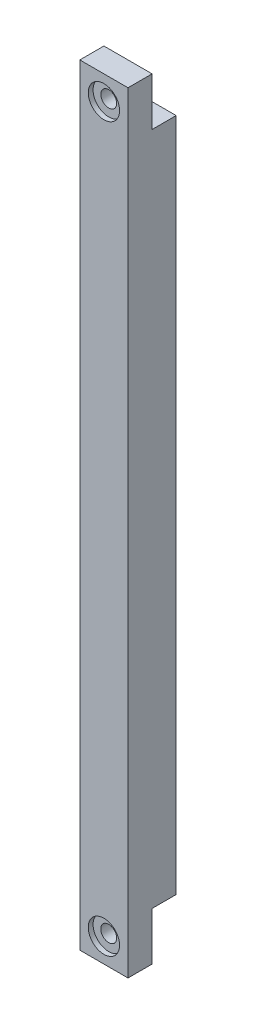
ISO-10303-21;
HEADER;
FILE_DESCRIPTION(('STEP AP214'),'2;1');
FILE_NAME('part.step','',(''),(''),'','','');
FILE_SCHEMA(('AUTOMOTIVE_DESIGN { 1 0 10303 214 1 1 1 1 }'));
ENDSEC;
DATA;
#1=APPLICATION_CONTEXT('core data for automotive mechanical design processes');
#2=APPLICATION_PROTOCOL_DEFINITION('international standard','automotive_design',2000,#1);
#3=PRODUCT_CONTEXT('',#1,'mechanical');
#4=PRODUCT('Part','Part','',(#3));
#5=PRODUCT_RELATED_PRODUCT_CATEGORY('part','',(#4));
#6=PRODUCT_DEFINITION_FORMATION('','',#4);
#7=PRODUCT_DEFINITION_CONTEXT('part definition',#1,'design');
#8=PRODUCT_DEFINITION('design','',#6,#7);
#9=PRODUCT_DEFINITION_SHAPE('','',#8);
#10=(LENGTH_UNIT() NAMED_UNIT(*) SI_UNIT(.MILLI.,.METRE.));
#11=(NAMED_UNIT(*) PLANE_ANGLE_UNIT() SI_UNIT($,.RADIAN.));
#12=(NAMED_UNIT(*) SI_UNIT($,.STERADIAN.) SOLID_ANGLE_UNIT());
#13=UNCERTAINTY_MEASURE_WITH_UNIT(LENGTH_MEASURE(1.E-05),#10,'distance_accuracy_value','');
#14=(GEOMETRIC_REPRESENTATION_CONTEXT(3) GLOBAL_UNCERTAINTY_ASSIGNED_CONTEXT((#13)) GLOBAL_UNIT_ASSIGNED_CONTEXT((#10,
#11,#12)) REPRESENTATION_CONTEXT('',''));
#15=CARTESIAN_POINT('',(0.,0.,0.));
#16=DIRECTION('',(0.,0.,1.));
#17=DIRECTION('',(1.,0.,0.));
#18=AXIS2_PLACEMENT_3D('',#15,#16,#17);
#19=CARTESIAN_POINT('',(5.00000000000002,-155.,10.));
#20=DIRECTION('',(0.,0.,1.));
#21=DIRECTION('',(1.,0.,0.));
#22=AXIS2_PLACEMENT_3D('',#19,#20,#21);
#23=CYLINDRICAL_SURFACE('',#22,1.65);
#24=CARTESIAN_POINT('',(5.00000000000002,-155.,5.));
#25=DIRECTION('',(0.,0.,1.));
#26=DIRECTION('',(1.,0.,0.));
#27=AXIS2_PLACEMENT_3D('',#24,#25,#26);
#28=CIRCLE('',#27,1.65);
#29=CARTESIAN_POINT('',(6.65000000000001,-155.,5.));
#30=VERTEX_POINT('',#29);
#31=EDGE_CURVE('E159',#30,#30,#28,.T.);
#32=ORIENTED_EDGE('',*,*,#31,.F.);
#33=EDGE_LOOP('',(#32));
#34=FACE_BOUND('',#33,.T.);
#35=CARTESIAN_POINT('',(5.00000000000002,-155.,9.));
#36=DIRECTION('',(0.,0.,1.));
#37=DIRECTION('',(1.,0.,0.));
#38=AXIS2_PLACEMENT_3D('',#35,#36,#37);
#39=CIRCLE('',#38,1.65);
#40=CARTESIAN_POINT('',(6.65000000000001,-155.,9.));
#41=VERTEX_POINT('',#40);
#42=EDGE_CURVE('E45',#41,#41,#39,.F.);
#43=ORIENTED_EDGE('',*,*,#42,.F.);
#44=EDGE_LOOP('',(#43));
#45=FACE_BOUND('',#44,.T.);
#46=ADVANCED_FACE('F41',(#34,#45),#23,.F.);
#47=CARTESIAN_POINT('',(5.00000000000001,-5.,10.));
#48=DIRECTION('',(0.,0.,1.));
#49=DIRECTION('',(1.,0.,0.));
#50=AXIS2_PLACEMENT_3D('',#47,#48,#49);
#51=CYLINDRICAL_SURFACE('',#50,1.65);
#52=CARTESIAN_POINT('',(5.00000000000001,-5.,5.));
#53=DIRECTION('',(0.,0.,-1.));
#54=DIRECTION('',(-1.,0.,0.));
#55=AXIS2_PLACEMENT_3D('',#52,#53,#54);
#56=CIRCLE('',#55,1.65);
#57=CARTESIAN_POINT('',(3.35000000000001,-5.,5.));
#58=VERTEX_POINT('',#57);
#59=EDGE_CURVE('E201',#58,#58,#56,.T.);
#60=ORIENTED_EDGE('',*,*,#59,.T.);
#61=EDGE_LOOP('',(#60));
#62=FACE_BOUND('',#61,.T.);
#63=CARTESIAN_POINT('',(5.00000000000001,-5.,9.));
#64=DIRECTION('',(0.,0.,1.));
#65=DIRECTION('',(1.,0.,0.));
#66=AXIS2_PLACEMENT_3D('',#63,#64,#65);
#67=CIRCLE('',#66,1.65);
#68=CARTESIAN_POINT('',(6.65000000000001,-5.,9.));
#69=VERTEX_POINT('',#68);
#70=EDGE_CURVE('E192',#69,#69,#67,.F.);
#71=ORIENTED_EDGE('',*,*,#70,.F.);
#72=EDGE_LOOP('',(#71));
#73=FACE_BOUND('',#72,.T.);
#74=ADVANCED_FACE('F250',(#62,#73),#51,.F.);
#75=CARTESIAN_POINT('',(0.,0.,10.));
#76=DIRECTION('',(0.,-1.,0.));
#77=DIRECTION('',(0.,0.,-1.));
#78=AXIS2_PLACEMENT_3D('',#75,#76,#77);
#79=PLANE('',#78);
#80=DIRECTION('',(1.,0.,0.));
#81=VECTOR('',#80,1.);
#82=CARTESIAN_POINT('',(10.,0.,5.));
#83=LINE('',#82,#81);
#84=CARTESIAN_POINT('',(0.,0.,5.));
#85=VERTEX_POINT('',#84);
#86=CARTESIAN_POINT('',(10.,0.,5.));
#87=VERTEX_POINT('',#86);
#88=EDGE_CURVE('E122',#85,#87,#83,.T.);
#89=ORIENTED_EDGE('',*,*,#88,.F.);
#90=DIRECTION('',(0.,0.,-1.));
#91=VECTOR('',#90,1.);
#92=CARTESIAN_POINT('',(0.,0.,10.));
#93=LINE('',#92,#91);
#94=CARTESIAN_POINT('',(0.,0.,10.));
#95=VERTEX_POINT('',#94);
#96=EDGE_CURVE('E178',#95,#85,#93,.T.);
#97=ORIENTED_EDGE('',*,*,#96,.F.);
#98=DIRECTION('',(-1.,0.,0.));
#99=VECTOR('',#98,1.);
#100=CARTESIAN_POINT('',(0.,0.,10.));
#101=LINE('',#100,#99);
#102=CARTESIAN_POINT('',(10.,0.,10.));
#103=VERTEX_POINT('',#102);
#104=EDGE_CURVE('E175',#103,#95,#101,.T.);
#105=ORIENTED_EDGE('',*,*,#104,.F.);
#106=DIRECTION('',(0.,0.,-1.));
#107=VECTOR('',#106,1.);
#108=CARTESIAN_POINT('',(10.,0.,10.));
#109=LINE('',#108,#107);
#110=EDGE_CURVE('E187',#103,#87,#109,.T.);
#111=ORIENTED_EDGE('',*,*,#110,.T.);
#112=EDGE_LOOP('',(#89,#97,#105,#111));
#113=FACE_BOUND('',#112,.T.);
#114=ADVANCED_FACE('F248',(#113),#79,.F.);
#115=CARTESIAN_POINT('',(0.,0.,10.));
#116=DIRECTION('',(1.,0.,0.));
#117=DIRECTION('',(0.,1.,0.));
#118=AXIS2_PLACEMENT_3D('',#115,#116,#117);
#119=PLANE('',#118);
#120=DIRECTION('',(0.,1.,0.));
#121=VECTOR('',#120,1.);
#122=CARTESIAN_POINT('',(0.,0.,5.));
#123=LINE('',#122,#121);
#124=CARTESIAN_POINT('',(0.,-10.,5.));
#125=VERTEX_POINT('',#124);
#126=EDGE_CURVE('E116',#125,#85,#123,.T.);
#127=ORIENTED_EDGE('',*,*,#126,.F.);
#128=DIRECTION('',(0.,0.,-1.));
#129=VECTOR('',#128,1.);
#130=CARTESIAN_POINT('',(0.,-10.,5.));
#131=LINE('',#130,#129);
#132=CARTESIAN_POINT('',(0.,-10.,0.));
#133=VERTEX_POINT('',#132);
#134=EDGE_CURVE('E112',#125,#133,#131,.T.);
#135=ORIENTED_EDGE('',*,*,#134,.T.);
#136=DIRECTION('',(0.,-1.,0.));
#137=VECTOR('',#136,1.);
#138=CARTESIAN_POINT('',(0.,0.,0.));
#139=LINE('',#138,#137);
#140=CARTESIAN_POINT('',(0.,-150.,0.));
#141=VERTEX_POINT('',#140);
#142=EDGE_CURVE('E138',#133,#141,#139,.T.);
#143=ORIENTED_EDGE('',*,*,#142,.T.);
#144=DIRECTION('',(0.,0.,-1.));
#145=VECTOR('',#144,1.);
#146=CARTESIAN_POINT('',(0.,-150.,5.));
#147=LINE('',#146,#145);
#148=CARTESIAN_POINT('',(0.,-150.,5.));
#149=VERTEX_POINT('',#148);
#150=EDGE_CURVE('E67',#149,#141,#147,.T.);
#151=ORIENTED_EDGE('',*,*,#150,.F.);
#152=DIRECTION('',(0.,1.,0.));
#153=VECTOR('',#152,1.);
#154=CARTESIAN_POINT('',(0.,-160.,5.));
#155=LINE('',#154,#153);
#156=CARTESIAN_POINT('',(0.,-160.,5.));
#157=VERTEX_POINT('',#156);
#158=EDGE_CURVE('E150',#157,#149,#155,.T.);
#159=ORIENTED_EDGE('',*,*,#158,.F.);
#160=DIRECTION('',(0.,0.,-1.));
#161=VECTOR('',#160,1.);
#162=CARTESIAN_POINT('',(0.,-160.,10.));
#163=LINE('',#162,#161);
#164=CARTESIAN_POINT('',(0.,-160.,10.));
#165=VERTEX_POINT('',#164);
#166=EDGE_CURVE('E11',#165,#157,#163,.T.);
#167=ORIENTED_EDGE('',*,*,#166,.F.);
#168=DIRECTION('',(0.,-1.,0.));
#169=VECTOR('',#168,1.);
#170=CARTESIAN_POINT('',(0.,0.,10.));
#171=LINE('',#170,#169);
#172=EDGE_CURVE('E165',#95,#165,#171,.T.);
#173=ORIENTED_EDGE('',*,*,#172,.F.);
#174=ORIENTED_EDGE('',*,*,#96,.T.);
#175=EDGE_LOOP('',(#127,#135,#143,#151,#159,#167,#173,#174));
#176=FACE_BOUND('',#175,.T.);
#177=ADVANCED_FACE('F43',(#176),#119,.F.);
#178=CARTESIAN_POINT('',(0.,-160.,10.));
#179=DIRECTION('',(0.,1.,0.));
#180=DIRECTION('',(0.,0.,1.));
#181=AXIS2_PLACEMENT_3D('',#178,#179,#180);
#182=PLANE('',#181);
#183=ORIENTED_EDGE('',*,*,#166,.T.);
#184=DIRECTION('',(-1.,0.,0.));
#185=VECTOR('',#184,1.);
#186=CARTESIAN_POINT('',(10.,-160.,5.));
#187=LINE('',#186,#185);
#188=CARTESIAN_POINT('',(10.,-160.,5.));
#189=VERTEX_POINT('',#188);
#190=EDGE_CURVE('E146',#189,#157,#187,.T.);
#191=ORIENTED_EDGE('',*,*,#190,.F.);
#192=DIRECTION('',(0.,0.,-1.));
#193=VECTOR('',#192,1.);
#194=CARTESIAN_POINT('',(10.,-160.,10.));
#195=LINE('',#194,#193);
#196=CARTESIAN_POINT('',(10.,-160.,10.));
#197=VERTEX_POINT('',#196);
#198=EDGE_CURVE('E51',#197,#189,#195,.T.);
#199=ORIENTED_EDGE('',*,*,#198,.F.);
#200=DIRECTION('',(1.,0.,0.));
#201=VECTOR('',#200,1.);
#202=CARTESIAN_POINT('',(0.,-160.,10.));
#203=LINE('',#202,#201);
#204=EDGE_CURVE('E169',#165,#197,#203,.T.);
#205=ORIENTED_EDGE('',*,*,#204,.F.);
#206=EDGE_LOOP('',(#183,#191,#199,#205));
#207=FACE_BOUND('',#206,.T.);
#208=ADVANCED_FACE('F240',(#207),#182,.F.);
#209=CARTESIAN_POINT('',(10.,0.,10.));
#210=DIRECTION('',(-1.,0.,0.));
#211=DIRECTION('',(0.,-1.,0.));
#212=AXIS2_PLACEMENT_3D('',#209,#210,#211);
#213=PLANE('',#212);
#214=DIRECTION('',(0.,1.,0.));
#215=VECTOR('',#214,1.);
#216=CARTESIAN_POINT('',(10.,0.,0.));
#217=LINE('',#216,#215);
#218=CARTESIAN_POINT('',(10.,-150.,0.));
#219=VERTEX_POINT('',#218);
#220=CARTESIAN_POINT('',(10.,-10.,0.));
#221=VERTEX_POINT('',#220);
#222=EDGE_CURVE('E133',#219,#221,#217,.T.);
#223=ORIENTED_EDGE('',*,*,#222,.T.);
#224=DIRECTION('',(0.,0.,-1.));
#225=VECTOR('',#224,1.);
#226=CARTESIAN_POINT('',(10.,-10.,5.));
#227=LINE('',#226,#225);
#228=CARTESIAN_POINT('',(10.,-10.,5.));
#229=VERTEX_POINT('',#228);
#230=EDGE_CURVE('E59',#229,#221,#227,.T.);
#231=ORIENTED_EDGE('',*,*,#230,.F.);
#232=DIRECTION('',(0.,-1.,0.));
#233=VECTOR('',#232,1.);
#234=CARTESIAN_POINT('',(10.,0.,5.));
#235=LINE('',#234,#233);
#236=EDGE_CURVE('E117',#87,#229,#235,.T.);
#237=ORIENTED_EDGE('',*,*,#236,.F.);
#238=ORIENTED_EDGE('',*,*,#110,.F.);
#239=DIRECTION('',(0.,1.,0.));
#240=VECTOR('',#239,1.);
#241=CARTESIAN_POINT('',(10.,0.,10.));
#242=LINE('',#241,#240);
#243=EDGE_CURVE('E172',#197,#103,#242,.T.);
#244=ORIENTED_EDGE('',*,*,#243,.F.);
#245=ORIENTED_EDGE('',*,*,#198,.T.);
#246=DIRECTION('',(0.,-1.,0.));
#247=VECTOR('',#246,1.);
#248=CARTESIAN_POINT('',(10.,-160.,5.));
#249=LINE('',#248,#247);
#250=CARTESIAN_POINT('',(10.,-150.,5.));
#251=VERTEX_POINT('',#250);
#252=EDGE_CURVE('E143',#251,#189,#249,.T.);
#253=ORIENTED_EDGE('',*,*,#252,.F.);
#254=DIRECTION('',(0.,0.,-1.));
#255=VECTOR('',#254,1.);
#256=CARTESIAN_POINT('',(10.,-150.,5.));
#257=LINE('',#256,#255);
#258=EDGE_CURVE('E160',#251,#219,#257,.T.);
#259=ORIENTED_EDGE('',*,*,#258,.T.);
#260=EDGE_LOOP('',(#223,#231,#237,#238,#244,#245,#253,#259));
#261=FACE_BOUND('',#260,.T.);
#262=ADVANCED_FACE('F130',(#261),#213,.F.);
#263=CARTESIAN_POINT('',(0.,0.,10.));
#264=DIRECTION('',(0.,0.,1.));
#265=DIRECTION('',(1.,0.,0.));
#266=AXIS2_PLACEMENT_3D('',#263,#264,#265);
#267=PLANE('',#266);
#268=CARTESIAN_POINT('',(5.00000000000001,-5.,10.));
#269=DIRECTION('',(0.,0.,1.));
#270=DIRECTION('',(1.,0.,0.));
#271=AXIS2_PLACEMENT_3D('',#268,#269,#270);
#272=CIRCLE('',#271,3.25);
#273=CARTESIAN_POINT('',(8.25000000000001,-5.,10.));
#274=VERTEX_POINT('',#273);
#275=EDGE_CURVE('E203',#274,#274,#272,.T.);
#276=ORIENTED_EDGE('',*,*,#275,.F.);
#277=EDGE_LOOP('',(#276));
#278=FACE_BOUND('',#277,.T.);
#279=CARTESIAN_POINT('',(5.00000000000001,-155.,10.));
#280=DIRECTION('',(0.,0.,1.));
#281=DIRECTION('',(1.,0.,0.));
#282=AXIS2_PLACEMENT_3D('',#279,#280,#281);
#283=CIRCLE('',#282,3.25);
#284=CARTESIAN_POINT('',(8.25000000000001,-155.,10.));
#285=VERTEX_POINT('',#284);
#286=EDGE_CURVE('E215',#285,#285,#283,.T.);
#287=ORIENTED_EDGE('',*,*,#286,.F.);
#288=EDGE_LOOP('',(#287));
#289=FACE_BOUND('',#288,.T.);
#290=ORIENTED_EDGE('',*,*,#172,.T.);
#291=ORIENTED_EDGE('',*,*,#204,.T.);
#292=ORIENTED_EDGE('',*,*,#243,.T.);
#293=ORIENTED_EDGE('',*,*,#104,.T.);
#294=EDGE_LOOP('',(#290,#291,#292,#293));
#295=FACE_BOUND('',#294,.T.);
#296=ADVANCED_FACE('F245',(#278,#289,#295),#267,.T.);
#297=CARTESIAN_POINT('',(0.,0.,0.));
#298=DIRECTION('',(0.,0.,1.));
#299=DIRECTION('',(1.,0.,0.));
#300=AXIS2_PLACEMENT_3D('',#297,#298,#299);
#301=PLANE('',#300);
#302=ORIENTED_EDGE('',*,*,#142,.F.);
#303=DIRECTION('',(-1.,0.,0.));
#304=VECTOR('',#303,1.);
#305=CARTESIAN_POINT('',(10.,-10.,0.));
#306=LINE('',#305,#304);
#307=EDGE_CURVE('E127',#221,#133,#306,.T.);
#308=ORIENTED_EDGE('',*,*,#307,.F.);
#309=ORIENTED_EDGE('',*,*,#222,.F.);
#310=DIRECTION('',(1.,0.,0.));
#311=VECTOR('',#310,1.);
#312=CARTESIAN_POINT('',(10.,-150.,0.));
#313=LINE('',#312,#311);
#314=EDGE_CURVE('E147',#141,#219,#313,.T.);
#315=ORIENTED_EDGE('',*,*,#314,.F.);
#316=EDGE_LOOP('',(#302,#308,#309,#315));
#317=FACE_BOUND('',#316,.T.);
#318=ADVANCED_FACE('F230',(#317),#301,.F.);
#319=CARTESIAN_POINT('',(10.,-150.,5.));
#320=DIRECTION('',(0.,1.,0.));
#321=DIRECTION('',(0.,0.,1.));
#322=AXIS2_PLACEMENT_3D('',#319,#320,#321);
#323=PLANE('',#322);
#324=ORIENTED_EDGE('',*,*,#314,.T.);
#325=ORIENTED_EDGE('',*,*,#258,.F.);
#326=DIRECTION('',(1.,0.,0.));
#327=VECTOR('',#326,1.);
#328=CARTESIAN_POINT('',(10.,-150.,5.));
#329=LINE('',#328,#327);
#330=EDGE_CURVE('E153',#149,#251,#329,.T.);
#331=ORIENTED_EDGE('',*,*,#330,.F.);
#332=ORIENTED_EDGE('',*,*,#150,.T.);
#333=EDGE_LOOP('',(#324,#325,#331,#332));
#334=FACE_BOUND('',#333,.T.);
#335=ADVANCED_FACE('F231',(#334),#323,.F.);
#336=CARTESIAN_POINT('',(0.,0.,5.));
#337=DIRECTION('',(0.,0.,1.));
#338=DIRECTION('',(1.,0.,0.));
#339=AXIS2_PLACEMENT_3D('',#336,#337,#338);
#340=PLANE('',#339);
#341=ORIENTED_EDGE('',*,*,#31,.T.);
#342=EDGE_LOOP('',(#341));
#343=FACE_BOUND('',#342,.T.);
#344=ORIENTED_EDGE('',*,*,#252,.T.);
#345=ORIENTED_EDGE('',*,*,#190,.T.);
#346=ORIENTED_EDGE('',*,*,#158,.T.);
#347=ORIENTED_EDGE('',*,*,#330,.T.);
#348=EDGE_LOOP('',(#344,#345,#346,#347));
#349=FACE_BOUND('',#348,.T.);
#350=ADVANCED_FACE('F237',(#343,#349),#340,.F.);
#351=CARTESIAN_POINT('',(10.,-10.,5.));
#352=DIRECTION('',(0.,-1.,0.));
#353=DIRECTION('',(0.,0.,-1.));
#354=AXIS2_PLACEMENT_3D('',#351,#352,#353);
#355=PLANE('',#354);
#356=ORIENTED_EDGE('',*,*,#307,.T.);
#357=ORIENTED_EDGE('',*,*,#134,.F.);
#358=DIRECTION('',(-1.,0.,0.));
#359=VECTOR('',#358,1.);
#360=CARTESIAN_POINT('',(10.,-10.,5.));
#361=LINE('',#360,#359);
#362=EDGE_CURVE('E108',#229,#125,#361,.T.);
#363=ORIENTED_EDGE('',*,*,#362,.F.);
#364=ORIENTED_EDGE('',*,*,#230,.T.);
#365=EDGE_LOOP('',(#356,#357,#363,#364));
#366=FACE_BOUND('',#365,.T.);
#367=ADVANCED_FACE('F110',(#366),#355,.F.);
#368=CARTESIAN_POINT('',(0.,0.,5.));
#369=DIRECTION('',(0.,0.,-1.));
#370=DIRECTION('',(-1.,0.,0.));
#371=AXIS2_PLACEMENT_3D('',#368,#369,#370);
#372=PLANE('',#371);
#373=ORIENTED_EDGE('',*,*,#59,.F.);
#374=EDGE_LOOP('',(#373));
#375=FACE_BOUND('',#374,.T.);
#376=ORIENTED_EDGE('',*,*,#236,.T.);
#377=ORIENTED_EDGE('',*,*,#362,.T.);
#378=ORIENTED_EDGE('',*,*,#126,.T.);
#379=ORIENTED_EDGE('',*,*,#88,.T.);
#380=EDGE_LOOP('',(#376,#377,#378,#379));
#381=FACE_BOUND('',#380,.T.);
#382=ADVANCED_FACE('F120',(#375,#381),#372,.T.);
#383=CARTESIAN_POINT('',(5.00000000000001,-5.,9.));
#384=DIRECTION('',(0.,0.,1.));
#385=DIRECTION('',(1.,0.,0.));
#386=AXIS2_PLACEMENT_3D('',#383,#384,#385);
#387=PLANE('',#386);
#388=CARTESIAN_POINT('',(5.00000000000001,-5.,9.));
#389=DIRECTION('',(0.,0.,1.));
#390=DIRECTION('',(1.,0.,0.));
#391=AXIS2_PLACEMENT_3D('',#388,#389,#390);
#392=CIRCLE('',#391,3.25);
#393=CARTESIAN_POINT('',(8.25000000000001,-5.,9.));
#394=VERTEX_POINT('',#393);
#395=EDGE_CURVE('E195',#394,#394,#392,.T.);
#396=ORIENTED_EDGE('',*,*,#395,.T.);
#397=EDGE_LOOP('',(#396));
#398=FACE_BOUND('',#397,.T.);
#399=ORIENTED_EDGE('',*,*,#70,.T.);
#400=EDGE_LOOP('',(#399));
#401=FACE_BOUND('',#400,.T.);
#402=ADVANCED_FACE('F271',(#398,#401),#387,.T.);
#403=CARTESIAN_POINT('',(5.00000000000001,-5.,9.));
#404=DIRECTION('',(0.,0.,1.));
#405=DIRECTION('',(1.,0.,0.));
#406=AXIS2_PLACEMENT_3D('',#403,#404,#405);
#407=CYLINDRICAL_SURFACE('',#406,3.25);
#408=ORIENTED_EDGE('',*,*,#395,.F.);
#409=EDGE_LOOP('',(#408));
#410=FACE_BOUND('',#409,.T.);
#411=ORIENTED_EDGE('',*,*,#275,.T.);
#412=EDGE_LOOP('',(#411));
#413=FACE_BOUND('',#412,.T.);
#414=ADVANCED_FACE('F312',(#410,#413),#407,.F.);
#415=CARTESIAN_POINT('',(5.00000000000001,-155.,9.));
#416=DIRECTION('',(0.,0.,1.));
#417=DIRECTION('',(1.,0.,0.));
#418=AXIS2_PLACEMENT_3D('',#415,#416,#417);
#419=PLANE('',#418);
#420=CARTESIAN_POINT('',(5.00000000000001,-155.,9.));
#421=DIRECTION('',(0.,0.,1.));
#422=DIRECTION('',(1.,0.,0.));
#423=AXIS2_PLACEMENT_3D('',#420,#421,#422);
#424=CIRCLE('',#423,3.25);
#425=CARTESIAN_POINT('',(8.25000000000001,-155.,9.));
#426=VERTEX_POINT('',#425);
#427=EDGE_CURVE('E209',#426,#426,#424,.T.);
#428=ORIENTED_EDGE('',*,*,#427,.T.);
#429=EDGE_LOOP('',(#428));
#430=FACE_BOUND('',#429,.T.);
#431=ORIENTED_EDGE('',*,*,#42,.T.);
#432=EDGE_LOOP('',(#431));
#433=FACE_BOUND('',#432,.T.);
#434=ADVANCED_FACE('F319',(#430,#433),#419,.T.);
#435=CARTESIAN_POINT('',(5.00000000000001,-155.,9.));
#436=DIRECTION('',(0.,0.,1.));
#437=DIRECTION('',(1.,0.,0.));
#438=AXIS2_PLACEMENT_3D('',#435,#436,#437);
#439=CYLINDRICAL_SURFACE('',#438,3.25);
#440=ORIENTED_EDGE('',*,*,#427,.F.);
#441=EDGE_LOOP('',(#440));
#442=FACE_BOUND('',#441,.T.);
#443=ORIENTED_EDGE('',*,*,#286,.T.);
#444=EDGE_LOOP('',(#443));
#445=FACE_BOUND('',#444,.T.);
#446=ADVANCED_FACE('F327',(#442,#445),#439,.F.);
#447=CLOSED_SHELL('',(#46,#74,#114,#177,#208,#262,#296,#318,#335,#350,#367,#382,#402,#414,#434,#446));
#448=MANIFOLD_SOLID_BREP('B2',#447);
#449=ADVANCED_BREP_SHAPE_REPRESENTATION('',(#18,#448),#14);
#450=SHAPE_DEFINITION_REPRESENTATION(#9,#449);
ENDSEC;
END-ISO-10303-21;
